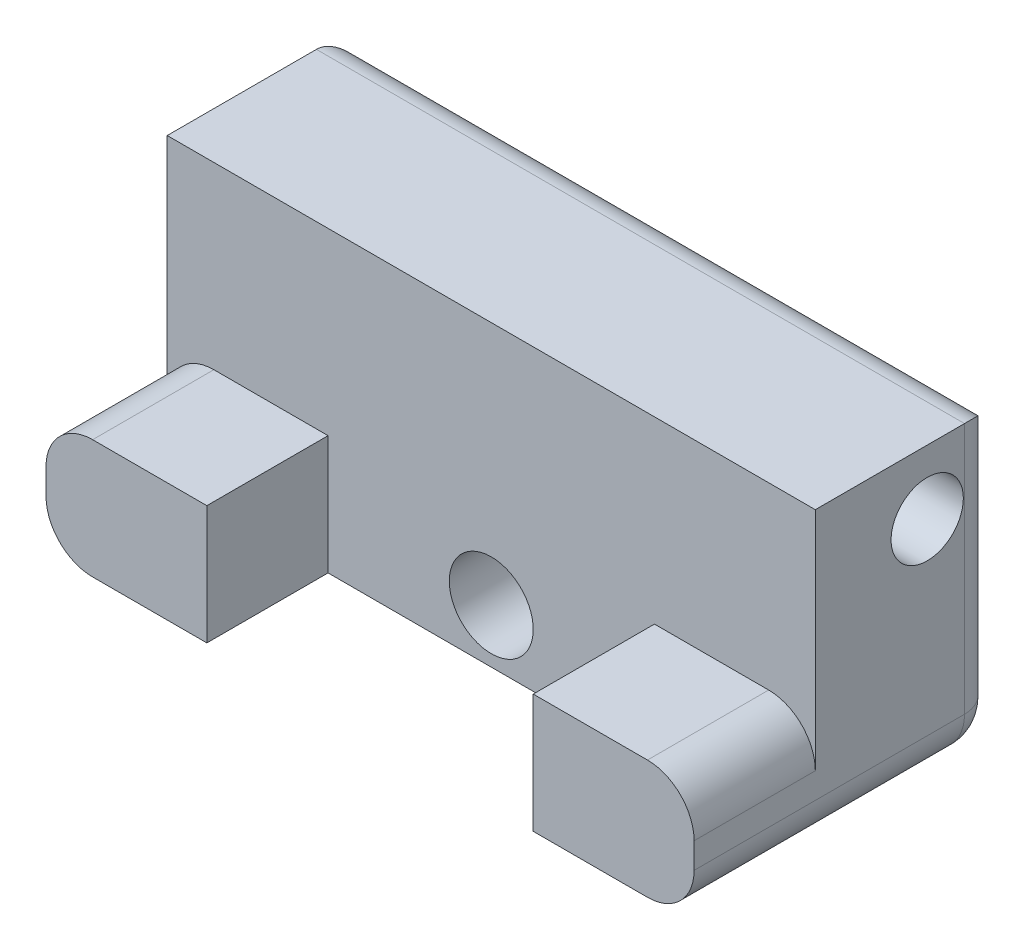
ISO-10303-21;
HEADER;
FILE_DESCRIPTION(('STEP AP214'),'2;1');
FILE_NAME('part.step','',(''),(''),'','','');
FILE_SCHEMA(('AUTOMOTIVE_DESIGN { 1 0 10303 214 1 1 1 1 }'));
ENDSEC;
DATA;
#1=APPLICATION_CONTEXT('core data for automotive mechanical design processes');
#2=APPLICATION_PROTOCOL_DEFINITION('international standard','automotive_design',2000,#1);
#3=PRODUCT_CONTEXT('',#1,'mechanical');
#4=PRODUCT('Part','Part','',(#3));
#5=PRODUCT_RELATED_PRODUCT_CATEGORY('part','',(#4));
#6=PRODUCT_DEFINITION_FORMATION('','',#4);
#7=PRODUCT_DEFINITION_CONTEXT('part definition',#1,'design');
#8=PRODUCT_DEFINITION('design','',#6,#7);
#9=PRODUCT_DEFINITION_SHAPE('','',#8);
#10=(LENGTH_UNIT() NAMED_UNIT(*) SI_UNIT(.MILLI.,.METRE.));
#11=(NAMED_UNIT(*) PLANE_ANGLE_UNIT() SI_UNIT($,.RADIAN.));
#12=(NAMED_UNIT(*) SI_UNIT($,.STERADIAN.) SOLID_ANGLE_UNIT());
#13=UNCERTAINTY_MEASURE_WITH_UNIT(LENGTH_MEASURE(1.E-05),#10,'distance_accuracy_value','');
#14=(GEOMETRIC_REPRESENTATION_CONTEXT(3) GLOBAL_UNCERTAINTY_ASSIGNED_CONTEXT((#13)) GLOBAL_UNIT_ASSIGNED_CONTEXT((#10,
#11,#12)) REPRESENTATION_CONTEXT('',''));
#15=CARTESIAN_POINT('',(0.,0.,0.));
#16=DIRECTION('',(0.,0.,1.));
#17=DIRECTION('',(1.,0.,0.));
#18=AXIS2_PLACEMENT_3D('',#15,#16,#17);
#19=CARTESIAN_POINT('',(27.8,0.,-13.));
#20=DIRECTION('',(0.,0.,1.));
#21=DIRECTION('',(1.,0.,0.));
#22=AXIS2_PLACEMENT_3D('',#19,#20,#21);
#23=PLANE('',#22);
#24=DIRECTION('',(0.,1.,0.));
#25=VECTOR('',#24,1.);
#26=CARTESIAN_POINT('',(1.4,0.,-13.));
#27=LINE('',#26,#25);
#28=CARTESIAN_POINT('',(1.4,2.7,-13.));
#29=VERTEX_POINT('',#28);
#30=CARTESIAN_POINT('',(1.4,12.1,-13.));
#31=VERTEX_POINT('',#30);
#32=EDGE_CURVE('E301',#29,#31,#27,.T.);
#33=ORIENTED_EDGE('',*,*,#32,.T.);
#34=DIRECTION('',(-1.,0.,0.));
#35=VECTOR('',#34,1.);
#36=CARTESIAN_POINT('',(27.8,12.1,-13.));
#37=LINE('',#36,#35);
#38=CARTESIAN_POINT('',(26.4,12.1,-13.));
#39=VERTEX_POINT('',#38);
#40=EDGE_CURVE('E303',#31,#39,#37,.F.);
#41=ORIENTED_EDGE('',*,*,#40,.T.);
#42=DIRECTION('',(0.,1.,0.));
#43=VECTOR('',#42,1.);
#44=CARTESIAN_POINT('',(26.4,2.7,-13.));
#45=LINE('',#44,#43);
#46=CARTESIAN_POINT('',(26.4,2.7,-13.));
#47=VERTEX_POINT('',#46);
#48=EDGE_CURVE('E289',#39,#47,#45,.F.);
#49=ORIENTED_EDGE('',*,*,#48,.T.);
#50=CARTESIAN_POINT('',(25.8,2.7,-13.));
#51=DIRECTION('',(0.,0.,1.));
#52=DIRECTION('',(1.,0.,0.));
#53=AXIS2_PLACEMENT_3D('',#50,#51,#52);
#54=CIRCLE('',#53,0.6);
#55=CARTESIAN_POINT('',(25.8,2.1,-13.));
#56=VERTEX_POINT('',#55);
#57=EDGE_CURVE('E291',#47,#56,#54,.F.);
#58=ORIENTED_EDGE('',*,*,#57,.T.);
#59=DIRECTION('',(1.,0.,0.));
#60=VECTOR('',#59,1.);
#61=CARTESIAN_POINT('',(27.8,2.1,-13.));
#62=LINE('',#61,#60);
#63=CARTESIAN_POINT('',(18.4620718977237,2.1,-13.));
#64=VERTEX_POINT('',#63);
#65=EDGE_CURVE('E293',#56,#64,#62,.F.);
#66=ORIENTED_EDGE('',*,*,#65,.T.);
#67=CARTESIAN_POINT('',(13.9,3.,-13.));
#68=DIRECTION('',(0.,0.,1.));
#69=DIRECTION('',(1.,0.,0.));
#70=AXIS2_PLACEMENT_3D('',#67,#68,#69);
#71=CIRCLE('',#70,4.65);
#72=CARTESIAN_POINT('',(9.33792810227633,2.1,-13.));
#73=VERTEX_POINT('',#72);
#74=EDGE_CURVE('E295',#64,#73,#71,.T.);
#75=ORIENTED_EDGE('',*,*,#74,.T.);
#76=DIRECTION('',(1.,0.,0.));
#77=VECTOR('',#76,1.);
#78=CARTESIAN_POINT('',(27.8,2.1,-13.));
#79=LINE('',#78,#77);
#80=CARTESIAN_POINT('',(2.,2.1,-13.));
#81=VERTEX_POINT('',#80);
#82=EDGE_CURVE('E297',#73,#81,#79,.F.);
#83=ORIENTED_EDGE('',*,*,#82,.T.);
#84=CARTESIAN_POINT('',(2.,2.7,-13.));
#85=DIRECTION('',(0.,0.,1.));
#86=DIRECTION('',(1.,0.,0.));
#87=AXIS2_PLACEMENT_3D('',#84,#85,#86);
#88=CIRCLE('',#87,0.6);
#89=EDGE_CURVE('E299',#81,#29,#88,.F.);
#90=ORIENTED_EDGE('',*,*,#89,.T.);
#91=EDGE_LOOP('',(#33,#41,#49,#58,#66,#75,#83,#90));
#92=FACE_BOUND('',#91,.T.);
#93=ADVANCED_FACE('F37',(#92),#23,.F.);
#94=CARTESIAN_POINT('',(27.8,5.8,0.));
#95=DIRECTION('',(0.,0.,-1.));
#96=DIRECTION('',(0.,1.,0.));
#97=AXIS2_PLACEMENT_3D('',#94,#95,#96);
#98=PLANE('',#97);
#99=DIRECTION('',(-1.,0.,0.));
#100=VECTOR('',#99,1.);
#101=CARTESIAN_POINT('',(27.8,5.8,0.));
#102=LINE('',#101,#100);
#103=CARTESIAN_POINT('',(6.9,5.8,0.));
#104=VERTEX_POINT('',#103);
#105=CARTESIAN_POINT('',(2.,5.8,0.));
#106=VERTEX_POINT('',#105);
#107=EDGE_CURVE('E233',#104,#106,#102,.T.);
#108=ORIENTED_EDGE('',*,*,#107,.T.);
#109=CARTESIAN_POINT('',(2.,3.8,0.));
#110=DIRECTION('',(0.,0.,-1.));
#111=DIRECTION('',(0.,1.,0.));
#112=AXIS2_PLACEMENT_3D('',#109,#110,#111);
#113=CIRCLE('',#112,2.);
#114=CARTESIAN_POINT('',(0.,3.8,0.));
#115=VERTEX_POINT('',#114);
#116=EDGE_CURVE('E274',#106,#115,#113,.F.);
#117=ORIENTED_EDGE('',*,*,#116,.T.);
#118=DIRECTION('',(0.,-1.,0.));
#119=VECTOR('',#118,1.);
#120=CARTESIAN_POINT('',(0.,5.8,0.));
#121=LINE('',#120,#119);
#122=CARTESIAN_POINT('',(0.,2.7,0.));
#123=VERTEX_POINT('',#122);
#124=EDGE_CURVE('E221',#115,#123,#121,.T.);
#125=ORIENTED_EDGE('',*,*,#124,.T.);
#126=CARTESIAN_POINT('',(2.,2.7,0.));
#127=DIRECTION('',(0.,0.,-1.));
#128=DIRECTION('',(0.,1.,0.));
#129=AXIS2_PLACEMENT_3D('',#126,#127,#128);
#130=CIRCLE('',#129,2.);
#131=CARTESIAN_POINT('',(2.,0.7,0.));
#132=VERTEX_POINT('',#131);
#133=EDGE_CURVE('E272',#123,#132,#130,.F.);
#134=ORIENTED_EDGE('',*,*,#133,.T.);
#135=DIRECTION('',(-1.,0.,0.));
#136=VECTOR('',#135,1.);
#137=CARTESIAN_POINT('',(0.,0.7,0.));
#138=LINE('',#137,#136);
#139=CARTESIAN_POINT('',(6.9,0.7,0.));
#140=VERTEX_POINT('',#139);
#141=EDGE_CURVE('E193',#140,#132,#138,.T.);
#142=ORIENTED_EDGE('',*,*,#141,.F.);
#143=DIRECTION('',(0.,1.,0.));
#144=VECTOR('',#143,1.);
#145=CARTESIAN_POINT('',(6.9,0.,0.));
#146=LINE('',#145,#144);
#147=EDGE_CURVE('E210',#140,#104,#146,.T.);
#148=ORIENTED_EDGE('',*,*,#147,.T.);
#149=EDGE_LOOP('',(#108,#117,#125,#134,#142,#148));
#150=FACE_BOUND('',#149,.T.);
#151=ADVANCED_FACE('F353',(#150),#98,.F.);
#152=CARTESIAN_POINT('',(27.8,5.8,-5.2));
#153=DIRECTION('',(0.,-1.,0.));
#154=DIRECTION('',(0.,0.,-1.));
#155=AXIS2_PLACEMENT_3D('',#152,#153,#154);
#156=PLANE('',#155);
#157=DIRECTION('',(-1.,0.,0.));
#158=VECTOR('',#157,1.);
#159=CARTESIAN_POINT('',(27.8,5.8,-5.2));
#160=LINE('',#159,#158);
#161=CARTESIAN_POINT('',(6.9,5.8,-5.2));
#162=VERTEX_POINT('',#161);
#163=CARTESIAN_POINT('',(2.,5.8,-5.2));
#164=VERTEX_POINT('',#163);
#165=EDGE_CURVE('E240',#162,#164,#160,.T.);
#166=ORIENTED_EDGE('',*,*,#165,.T.);
#167=DIRECTION('',(0.,0.,1.));
#168=VECTOR('',#167,1.);
#169=CARTESIAN_POINT('',(2.,5.8,-5.2));
#170=LINE('',#169,#168);
#171=EDGE_CURVE('E269',#164,#106,#170,.T.);
#172=ORIENTED_EDGE('',*,*,#171,.T.);
#173=ORIENTED_EDGE('',*,*,#107,.F.);
#174=DIRECTION('',(0.,0.,1.));
#175=VECTOR('',#174,1.);
#176=CARTESIAN_POINT('',(6.9,5.8,-5.2));
#177=LINE('',#176,#175);
#178=EDGE_CURVE('E250',#162,#104,#177,.T.);
#179=ORIENTED_EDGE('',*,*,#178,.F.);
#180=EDGE_LOOP('',(#166,#172,#173,#179));
#181=FACE_BOUND('',#180,.T.);
#182=ADVANCED_FACE('F359',(#181),#156,.F.);
#183=CARTESIAN_POINT('',(27.8,0.,0.));
#184=DIRECTION('',(1.,0.,0.));
#185=DIRECTION('',(0.,0.,-1.));
#186=AXIS2_PLACEMENT_3D('',#183,#184,#185);
#187=PLANE('',#186);
#188=DIRECTION('',(0.,0.,1.));
#189=VECTOR('',#188,1.);
#190=CARTESIAN_POINT('',(27.8,2.7,-13.));
#191=LINE('',#190,#189);
#192=CARTESIAN_POINT('',(27.8,2.7,0.));
#193=VERTEX_POINT('',#192);
#194=CARTESIAN_POINT('',(27.8,2.7,-11.6));
#195=VERTEX_POINT('',#194);
#196=EDGE_CURVE('E255',#193,#195,#191,.F.);
#197=ORIENTED_EDGE('',*,*,#196,.T.);
#198=DIRECTION('',(0.,1.,0.));
#199=VECTOR('',#198,1.);
#200=CARTESIAN_POINT('',(27.8,13.5,-11.6));
#201=LINE('',#200,#199);
#202=CARTESIAN_POINT('',(27.8,13.5,-11.6));
#203=VERTEX_POINT('',#202);
#204=EDGE_CURVE('E11',#195,#203,#201,.T.);
#205=ORIENTED_EDGE('',*,*,#204,.T.);
#206=DIRECTION('',(0.,0.,1.));
#207=VECTOR('',#206,1.);
#208=CARTESIAN_POINT('',(27.8,13.5,-13.));
#209=LINE('',#208,#207);
#210=CARTESIAN_POINT('',(27.8,13.5,-5.2));
#211=VERTEX_POINT('',#210);
#212=EDGE_CURVE('E228',#203,#211,#209,.T.);
#213=ORIENTED_EDGE('',*,*,#212,.T.);
#214=DIRECTION('',(0.,-1.,0.));
#215=VECTOR('',#214,1.);
#216=CARTESIAN_POINT('',(27.8,13.5,-5.2));
#217=LINE('',#216,#215);
#218=CARTESIAN_POINT('',(27.8,3.8,-5.2));
#219=VERTEX_POINT('',#218);
#220=EDGE_CURVE('E231',#211,#219,#217,.T.);
#221=ORIENTED_EDGE('',*,*,#220,.T.);
#222=DIRECTION('',(0.,0.,1.));
#223=VECTOR('',#222,1.);
#224=CARTESIAN_POINT('',(27.8,3.8,0.));
#225=LINE('',#224,#223);
#226=CARTESIAN_POINT('',(27.8,3.8,0.));
#227=VERTEX_POINT('',#226);
#228=EDGE_CURVE('E257',#219,#227,#225,.T.);
#229=ORIENTED_EDGE('',*,*,#228,.T.);
#230=DIRECTION('',(0.,-1.,0.));
#231=VECTOR('',#230,1.);
#232=CARTESIAN_POINT('',(27.8,5.8,0.));
#233=LINE('',#232,#231);
#234=EDGE_CURVE('E225',#227,#193,#233,.T.);
#235=ORIENTED_EDGE('',*,*,#234,.T.);
#236=EDGE_LOOP('',(#197,#205,#213,#221,#229,#235));
#237=FACE_BOUND('',#236,.T.);
#238=CARTESIAN_POINT('',(27.8,10.75,-10.));
#239=DIRECTION('',(1.,0.,0.));
#240=DIRECTION('',(0.,0.,-1.));
#241=AXIS2_PLACEMENT_3D('',#238,#239,#240);
#242=CIRCLE('',#241,1.55);
#243=CARTESIAN_POINT('',(27.8,10.75,-11.55));
#244=VERTEX_POINT('',#243);
#245=EDGE_CURVE('E218',#244,#244,#242,.T.);
#246=ORIENTED_EDGE('',*,*,#245,.F.);
#247=EDGE_LOOP('',(#246));
#248=FACE_BOUND('',#247,.T.);
#249=ADVANCED_FACE('F422',(#237,#248),#187,.T.);
#250=CARTESIAN_POINT('',(0.,0.,0.));
#251=DIRECTION('',(1.,0.,0.));
#252=DIRECTION('',(0.,0.,-1.));
#253=AXIS2_PLACEMENT_3D('',#250,#251,#252);
#254=PLANE('',#253);
#255=DIRECTION('',(0.,0.,1.));
#256=VECTOR('',#255,1.);
#257=CARTESIAN_POINT('',(0.,13.5,-13.));
#258=LINE('',#257,#256);
#259=CARTESIAN_POINT('',(0.,13.5,-11.6));
#260=VERTEX_POINT('',#259);
#261=CARTESIAN_POINT('',(0.,13.5,-5.2));
#262=VERTEX_POINT('',#261);
#263=EDGE_CURVE('E236',#260,#262,#258,.T.);
#264=ORIENTED_EDGE('',*,*,#263,.F.);
#265=DIRECTION('',(0.,1.,0.));
#266=VECTOR('',#265,1.);
#267=CARTESIAN_POINT('',(0.,0.,-11.6));
#268=LINE('',#267,#266);
#269=CARTESIAN_POINT('',(0.,2.7,-11.6));
#270=VERTEX_POINT('',#269);
#271=EDGE_CURVE('E306',#260,#270,#268,.F.);
#272=ORIENTED_EDGE('',*,*,#271,.T.);
#273=DIRECTION('',(0.,0.,-1.));
#274=VECTOR('',#273,1.);
#275=CARTESIAN_POINT('',(0.,2.7,0.));
#276=LINE('',#275,#274);
#277=EDGE_CURVE('E276',#270,#123,#276,.F.);
#278=ORIENTED_EDGE('',*,*,#277,.T.);
#279=ORIENTED_EDGE('',*,*,#124,.F.);
#280=DIRECTION('',(0.,0.,1.));
#281=VECTOR('',#280,1.);
#282=CARTESIAN_POINT('',(0.,3.8,0.));
#283=LINE('',#282,#281);
#284=CARTESIAN_POINT('',(0.,3.8,-5.2));
#285=VERTEX_POINT('',#284);
#286=EDGE_CURVE('E278',#115,#285,#283,.F.);
#287=ORIENTED_EDGE('',*,*,#286,.T.);
#288=DIRECTION('',(0.,-1.,0.));
#289=VECTOR('',#288,1.);
#290=CARTESIAN_POINT('',(0.,13.5,-5.2));
#291=LINE('',#290,#289);
#292=EDGE_CURVE('E229',#262,#285,#291,.T.);
#293=ORIENTED_EDGE('',*,*,#292,.F.);
#294=EDGE_LOOP('',(#264,#272,#278,#279,#287,#293));
#295=FACE_BOUND('',#294,.T.);
#296=CARTESIAN_POINT('',(0.,10.75,-10.));
#297=DIRECTION('',(1.,0.,0.));
#298=DIRECTION('',(0.,0.,-1.));
#299=AXIS2_PLACEMENT_3D('',#296,#297,#298);
#300=CIRCLE('',#299,1.55);
#301=CARTESIAN_POINT('',(0.,10.75,-11.55));
#302=VERTEX_POINT('',#301);
#303=EDGE_CURVE('E222',#302,#302,#300,.T.);
#304=ORIENTED_EDGE('',*,*,#303,.T.);
#305=EDGE_LOOP('',(#304));
#306=FACE_BOUND('',#305,.T.);
#307=ADVANCED_FACE('F367',(#295,#306),#254,.F.);
#308=ORIENTED_EDGE('',*,*,#234,.F.);
#309=CARTESIAN_POINT('',(25.8,3.8,0.));
#310=DIRECTION('',(0.,0.,-1.));
#311=DIRECTION('',(0.,1.,0.));
#312=AXIS2_PLACEMENT_3D('',#309,#310,#311);
#313=CIRCLE('',#312,2.);
#314=CARTESIAN_POINT('',(25.8,5.8,0.));
#315=VERTEX_POINT('',#314);
#316=EDGE_CURVE('E262',#227,#315,#313,.F.);
#317=ORIENTED_EDGE('',*,*,#316,.T.);
#318=CARTESIAN_POINT('',(20.9,5.8,0.));
#319=VERTEX_POINT('',#318);
#320=EDGE_CURVE('E209',#315,#319,#102,.T.);
#321=ORIENTED_EDGE('',*,*,#320,.T.);
#322=DIRECTION('',(0.,1.,0.));
#323=VECTOR('',#322,1.);
#324=CARTESIAN_POINT('',(20.9,0.,0.));
#325=LINE('',#324,#323);
#326=CARTESIAN_POINT('',(20.9,0.7,0.));
#327=VERTEX_POINT('',#326);
#328=EDGE_CURVE('E200',#327,#319,#325,.T.);
#329=ORIENTED_EDGE('',*,*,#328,.F.);
#330=CARTESIAN_POINT('',(25.8,0.7,0.));
#331=VERTEX_POINT('',#330);
#332=EDGE_CURVE('E182',#331,#327,#138,.T.);
#333=ORIENTED_EDGE('',*,*,#332,.F.);
#334=CARTESIAN_POINT('',(25.8,2.7,0.));
#335=DIRECTION('',(0.,0.,-1.));
#336=DIRECTION('',(0.,1.,0.));
#337=AXIS2_PLACEMENT_3D('',#334,#335,#336);
#338=CIRCLE('',#337,2.);
#339=EDGE_CURVE('E260',#331,#193,#338,.F.);
#340=ORIENTED_EDGE('',*,*,#339,.T.);
#341=EDGE_LOOP('',(#308,#317,#321,#329,#333,#340));
#342=FACE_BOUND('',#341,.T.);
#343=ADVANCED_FACE('F207',(#342),#98,.F.);
#344=CARTESIAN_POINT('',(27.8,13.5,-13.));
#345=DIRECTION('',(0.,-1.,0.));
#346=DIRECTION('',(0.,0.,-1.));
#347=AXIS2_PLACEMENT_3D('',#344,#345,#346);
#348=PLANE('',#347);
#349=ORIENTED_EDGE('',*,*,#212,.F.);
#350=DIRECTION('',(-1.,0.,0.));
#351=VECTOR('',#350,1.);
#352=CARTESIAN_POINT('',(27.8,13.5,-11.6));
#353=LINE('',#352,#351);
#354=EDGE_CURVE('E286',#203,#260,#353,.T.);
#355=ORIENTED_EDGE('',*,*,#354,.T.);
#356=ORIENTED_EDGE('',*,*,#263,.T.);
#357=DIRECTION('',(-1.,0.,0.));
#358=VECTOR('',#357,1.);
#359=CARTESIAN_POINT('',(27.8,13.5,-5.2));
#360=LINE('',#359,#358);
#361=EDGE_CURVE('E243',#211,#262,#360,.T.);
#362=ORIENTED_EDGE('',*,*,#361,.F.);
#363=EDGE_LOOP('',(#349,#355,#356,#362));
#364=FACE_BOUND('',#363,.T.);
#365=ADVANCED_FACE('F363',(#364),#348,.F.);
#366=CARTESIAN_POINT('',(27.8,13.5,-5.2));
#367=DIRECTION('',(0.,0.,-1.));
#368=DIRECTION('',(0.,1.,0.));
#369=AXIS2_PLACEMENT_3D('',#366,#367,#368);
#370=PLANE('',#369);
#371=CARTESIAN_POINT('',(13.9,3.,-5.2));
#372=DIRECTION('',(0.,0.,-1.));
#373=DIRECTION('',(0.,1.,0.));
#374=AXIS2_PLACEMENT_3D('',#371,#372,#373);
#375=CIRCLE('',#374,1.8);
#376=CARTESIAN_POINT('',(13.9,4.8,-5.2));
#377=VERTEX_POINT('',#376);
#378=EDGE_CURVE('E247',#377,#377,#375,.T.);
#379=ORIENTED_EDGE('',*,*,#378,.T.);
#380=EDGE_LOOP('',(#379));
#381=FACE_BOUND('',#380,.T.);
#382=DIRECTION('',(0.,1.,0.));
#383=VECTOR('',#382,1.);
#384=CARTESIAN_POINT('',(6.9,0.,-5.2));
#385=LINE('',#384,#383);
#386=CARTESIAN_POINT('',(6.9,0.699999999999999,-5.2));
#387=VERTEX_POINT('',#386);
#388=EDGE_CURVE('E212',#387,#162,#385,.T.);
#389=ORIENTED_EDGE('',*,*,#388,.F.);
#390=DIRECTION('',(1.,0.,0.));
#391=VECTOR('',#390,1.);
#392=CARTESIAN_POINT('',(27.8,0.699999999999999,-5.2));
#393=LINE('',#392,#391);
#394=CARTESIAN_POINT('',(20.9,0.7,-5.2));
#395=VERTEX_POINT('',#394);
#396=EDGE_CURVE('E204',#387,#395,#393,.T.);
#397=ORIENTED_EDGE('',*,*,#396,.T.);
#398=DIRECTION('',(0.,1.,0.));
#399=VECTOR('',#398,1.);
#400=CARTESIAN_POINT('',(20.9,0.,-5.2));
#401=LINE('',#400,#399);
#402=CARTESIAN_POINT('',(20.9,5.8,-5.2));
#403=VERTEX_POINT('',#402);
#404=EDGE_CURVE('E203',#395,#403,#401,.T.);
#405=ORIENTED_EDGE('',*,*,#404,.T.);
#406=CARTESIAN_POINT('',(25.8,5.8,-5.2));
#407=VERTEX_POINT('',#406);
#408=EDGE_CURVE('E241',#407,#403,#160,.T.);
#409=ORIENTED_EDGE('',*,*,#408,.F.);
#410=CARTESIAN_POINT('',(25.8,3.8,-5.2));
#411=DIRECTION('',(0.,0.,-1.));
#412=DIRECTION('',(0.,1.,0.));
#413=AXIS2_PLACEMENT_3D('',#410,#411,#412);
#414=CIRCLE('',#413,2.);
#415=EDGE_CURVE('E281',#407,#219,#414,.T.);
#416=ORIENTED_EDGE('',*,*,#415,.T.);
#417=ORIENTED_EDGE('',*,*,#220,.F.);
#418=ORIENTED_EDGE('',*,*,#361,.T.);
#419=ORIENTED_EDGE('',*,*,#292,.T.);
#420=CARTESIAN_POINT('',(2.,3.8,-5.2));
#421=DIRECTION('',(0.,0.,-1.));
#422=DIRECTION('',(0.,1.,0.));
#423=AXIS2_PLACEMENT_3D('',#420,#421,#422);
#424=CIRCLE('',#423,2.);
#425=EDGE_CURVE('E284',#285,#164,#424,.T.);
#426=ORIENTED_EDGE('',*,*,#425,.T.);
#427=ORIENTED_EDGE('',*,*,#165,.F.);
#428=EDGE_LOOP('',(#389,#397,#405,#409,#416,#417,#418,#419,#426,#427));
#429=FACE_BOUND('',#428,.T.);
#430=ADVANCED_FACE('F450',(#381,#429),#370,.F.);
#431=ORIENTED_EDGE('',*,*,#320,.F.);
#432=DIRECTION('',(0.,0.,1.));
#433=VECTOR('',#432,1.);
#434=CARTESIAN_POINT('',(25.8,5.8,-5.2));
#435=LINE('',#434,#433);
#436=EDGE_CURVE('E264',#315,#407,#435,.F.);
#437=ORIENTED_EDGE('',*,*,#436,.T.);
#438=ORIENTED_EDGE('',*,*,#408,.T.);
#439=DIRECTION('',(0.,0.,-1.));
#440=VECTOR('',#439,1.);
#441=CARTESIAN_POINT('',(20.9,5.8,-5.2));
#442=LINE('',#441,#440);
#443=EDGE_CURVE('E214',#319,#403,#442,.T.);
#444=ORIENTED_EDGE('',*,*,#443,.F.);
#445=EDGE_LOOP('',(#431,#437,#438,#444));
#446=FACE_BOUND('',#445,.T.);
#447=ADVANCED_FACE('F430',(#446),#156,.F.);
#448=CARTESIAN_POINT('',(27.8,10.75,-10.));
#449=DIRECTION('',(-1.,0.,0.));
#450=DIRECTION('',(0.,0.,1.));
#451=AXIS2_PLACEMENT_3D('',#448,#449,#450);
#452=CYLINDRICAL_SURFACE('',#451,1.55);
#453=ORIENTED_EDGE('',*,*,#245,.T.);
#454=EDGE_LOOP('',(#453));
#455=FACE_BOUND('',#454,.T.);
#456=ORIENTED_EDGE('',*,*,#303,.F.);
#457=EDGE_LOOP('',(#456));
#458=FACE_BOUND('',#457,.T.);
#459=ADVANCED_FACE('F482',(#455,#458),#452,.F.);
#460=CARTESIAN_POINT('',(6.9,0.,-5.2));
#461=DIRECTION('',(-1.,0.,0.));
#462=DIRECTION('',(0.,0.,1.));
#463=AXIS2_PLACEMENT_3D('',#460,#461,#462);
#464=PLANE('',#463);
#465=ORIENTED_EDGE('',*,*,#147,.F.);
#466=DIRECTION('',(0.,0.,-1.));
#467=VECTOR('',#466,1.);
#468=CARTESIAN_POINT('',(6.9,0.7,-5.2));
#469=LINE('',#468,#467);
#470=EDGE_CURVE('E443',#140,#387,#469,.T.);
#471=ORIENTED_EDGE('',*,*,#470,.T.);
#472=ORIENTED_EDGE('',*,*,#388,.T.);
#473=ORIENTED_EDGE('',*,*,#178,.T.);
#474=EDGE_LOOP('',(#465,#471,#472,#473));
#475=FACE_BOUND('',#474,.T.);
#476=ADVANCED_FACE('F441',(#475),#464,.F.);
#477=CARTESIAN_POINT('',(20.9,0.,-5.2));
#478=DIRECTION('',(1.,0.,0.));
#479=DIRECTION('',(0.,0.,-1.));
#480=AXIS2_PLACEMENT_3D('',#477,#478,#479);
#481=PLANE('',#480);
#482=ORIENTED_EDGE('',*,*,#404,.F.);
#483=DIRECTION('',(0.,0.,1.));
#484=VECTOR('',#483,1.);
#485=CARTESIAN_POINT('',(20.9,0.7,-5.2));
#486=LINE('',#485,#484);
#487=EDGE_CURVE('E186',#395,#327,#486,.T.);
#488=ORIENTED_EDGE('',*,*,#487,.T.);
#489=ORIENTED_EDGE('',*,*,#328,.T.);
#490=ORIENTED_EDGE('',*,*,#443,.T.);
#491=EDGE_LOOP('',(#482,#488,#489,#490));
#492=FACE_BOUND('',#491,.T.);
#493=ADVANCED_FACE('F198',(#492),#481,.F.);
#494=CARTESIAN_POINT('',(15.7,3.,-9.6));
#495=DIRECTION('',(0.,0.,1.));
#496=DIRECTION('',(1.,0.,0.));
#497=AXIS2_PLACEMENT_3D('',#494,#495,#496);
#498=PLANE('',#497);
#499=CARTESIAN_POINT('',(13.9,3.,-9.6));
#500=DIRECTION('',(0.,0.,-1.));
#501=DIRECTION('',(-1.,0.,0.));
#502=AXIS2_PLACEMENT_3D('',#499,#500,#501);
#503=CIRCLE('',#502,1.8);
#504=CARTESIAN_POINT('',(12.1,3.,-9.6));
#505=VERTEX_POINT('',#504);
#506=EDGE_CURVE('E251',#505,#505,#503,.T.);
#507=ORIENTED_EDGE('',*,*,#506,.F.);
#508=EDGE_LOOP('',(#507));
#509=FACE_BOUND('',#508,.T.);
#510=CARTESIAN_POINT('',(13.9,3.,-9.6));
#511=DIRECTION('',(0.,0.,-1.));
#512=DIRECTION('',(-1.,0.,0.));
#513=AXIS2_PLACEMENT_3D('',#510,#511,#512);
#514=CIRCLE('',#513,3.25);
#515=CARTESIAN_POINT('',(11.603807499359,0.7,-9.6));
#516=VERTEX_POINT('',#515);
#517=CARTESIAN_POINT('',(16.196192500641,0.7,-9.6));
#518=VERTEX_POINT('',#517);
#519=EDGE_CURVE('E413',#516,#518,#514,.T.);
#520=ORIENTED_EDGE('',*,*,#519,.T.);
#521=DIRECTION('',(-1.,0.,0.));
#522=VECTOR('',#521,1.);
#523=CARTESIAN_POINT('',(15.7,0.7,-9.6));
#524=LINE('',#523,#522);
#525=EDGE_CURVE('E192',#518,#516,#524,.T.);
#526=ORIENTED_EDGE('',*,*,#525,.T.);
#527=EDGE_LOOP('',(#520,#526));
#528=FACE_BOUND('',#527,.T.);
#529=ADVANCED_FACE('F467',(#509,#528),#498,.F.);
#530=CARTESIAN_POINT('',(13.9,3.,-13.));
#531=DIRECTION('',(0.,0.,-1.));
#532=DIRECTION('',(-1.,0.,0.));
#533=AXIS2_PLACEMENT_3D('',#530,#531,#532);
#534=CYLINDRICAL_SURFACE('',#533,1.8);
#535=ORIENTED_EDGE('',*,*,#506,.T.);
#536=EDGE_LOOP('',(#535));
#537=FACE_BOUND('',#536,.T.);
#538=ORIENTED_EDGE('',*,*,#378,.F.);
#539=EDGE_LOOP('',(#538));
#540=FACE_BOUND('',#539,.T.);
#541=ADVANCED_FACE('F464',(#537,#540),#534,.F.);
#542=CARTESIAN_POINT('',(13.9,3.,-13.));
#543=DIRECTION('',(0.,0.,-1.));
#544=DIRECTION('',(-1.,0.,0.));
#545=AXIS2_PLACEMENT_3D('',#542,#543,#544);
#546=CYLINDRICAL_SURFACE('',#545,3.25);
#547=DIRECTION('',(0.,0.,-1.));
#548=VECTOR('',#547,1.);
#549=CARTESIAN_POINT('',(11.603807499359,0.7,-13.));
#550=LINE('',#549,#548);
#551=CARTESIAN_POINT('',(11.603807499359,0.7,-11.6));
#552=VERTEX_POINT('',#551);
#553=EDGE_CURVE('E246',#516,#552,#550,.T.);
#554=ORIENTED_EDGE('',*,*,#553,.T.);
#555=CARTESIAN_POINT('',(13.9,3.,-11.6));
#556=DIRECTION('',(0.,0.,1.));
#557=DIRECTION('',(1.,0.,0.));
#558=AXIS2_PLACEMENT_3D('',#555,#556,#557);
#559=CIRCLE('',#558,3.25);
#560=CARTESIAN_POINT('',(16.196192500641,0.7,-11.6));
#561=VERTEX_POINT('',#560);
#562=EDGE_CURVE('E67',#552,#561,#559,.F.);
#563=ORIENTED_EDGE('',*,*,#562,.T.);
#564=DIRECTION('',(0.,0.,-1.));
#565=VECTOR('',#564,1.);
#566=CARTESIAN_POINT('',(16.196192500641,0.7,-13.));
#567=LINE('',#566,#565);
#568=EDGE_CURVE('E253',#561,#518,#567,.F.);
#569=ORIENTED_EDGE('',*,*,#568,.T.);
#570=ORIENTED_EDGE('',*,*,#519,.F.);
#571=EDGE_LOOP('',(#554,#563,#569,#570));
#572=FACE_BOUND('',#571,.T.);
#573=ADVANCED_FACE('F411',(#572),#546,.F.);
#574=CARTESIAN_POINT('',(0.,0.7,0.));
#575=DIRECTION('',(0.,1.,0.));
#576=DIRECTION('',(0.,0.,1.));
#577=AXIS2_PLACEMENT_3D('',#574,#575,#576);
#578=PLANE('',#577);
#579=DIRECTION('',(0.,0.,-1.));
#580=VECTOR('',#579,1.);
#581=CARTESIAN_POINT('',(2.,0.7,0.));
#582=LINE('',#581,#580);
#583=CARTESIAN_POINT('',(2.,0.7,-11.6));
#584=VERTEX_POINT('',#583);
#585=EDGE_CURVE('E266',#132,#584,#582,.T.);
#586=ORIENTED_EDGE('',*,*,#585,.T.);
#587=DIRECTION('',(1.,0.,0.));
#588=VECTOR('',#587,1.);
#589=CARTESIAN_POINT('',(0.,0.7,-11.6));
#590=LINE('',#589,#588);
#591=EDGE_CURVE('E312',#584,#552,#590,.T.);
#592=ORIENTED_EDGE('',*,*,#591,.T.);
#593=ORIENTED_EDGE('',*,*,#553,.F.);
#594=ORIENTED_EDGE('',*,*,#525,.F.);
#595=ORIENTED_EDGE('',*,*,#568,.F.);
#596=DIRECTION('',(1.,0.,0.));
#597=VECTOR('',#596,1.);
#598=CARTESIAN_POINT('',(0.,0.7,-11.6));
#599=LINE('',#598,#597);
#600=CARTESIAN_POINT('',(25.8,0.7,-11.6));
#601=VERTEX_POINT('',#600);
#602=EDGE_CURVE('E310',#561,#601,#599,.T.);
#603=ORIENTED_EDGE('',*,*,#602,.T.);
#604=DIRECTION('',(0.,0.,1.));
#605=VECTOR('',#604,1.);
#606=CARTESIAN_POINT('',(25.8,0.7,0.));
#607=LINE('',#606,#605);
#608=EDGE_CURVE('E188',#601,#331,#607,.T.);
#609=ORIENTED_EDGE('',*,*,#608,.T.);
#610=ORIENTED_EDGE('',*,*,#332,.T.);
#611=ORIENTED_EDGE('',*,*,#487,.F.);
#612=ORIENTED_EDGE('',*,*,#396,.F.);
#613=ORIENTED_EDGE('',*,*,#470,.F.);
#614=ORIENTED_EDGE('',*,*,#141,.T.);
#615=EDGE_LOOP('',(#586,#592,#593,#594,#595,#603,#609,#610,#611,#612,#613,#614));
#616=FACE_BOUND('',#615,.T.);
#617=ADVANCED_FACE('F185',(#616),#578,.F.);
#618=CARTESIAN_POINT('',(25.8,3.8,0.));
#619=DIRECTION('',(0.,0.,-1.));
#620=DIRECTION('',(0.,1.,0.));
#621=AXIS2_PLACEMENT_3D('',#618,#619,#620);
#622=CYLINDRICAL_SURFACE('',#621,2.);
#623=ORIENTED_EDGE('',*,*,#415,.F.);
#624=ORIENTED_EDGE('',*,*,#436,.F.);
#625=ORIENTED_EDGE('',*,*,#316,.F.);
#626=ORIENTED_EDGE('',*,*,#228,.F.);
#627=EDGE_LOOP('',(#623,#624,#625,#626));
#628=FACE_BOUND('',#627,.T.);
#629=ADVANCED_FACE('F368',(#628),#622,.T.);
#630=CARTESIAN_POINT('',(25.8,2.7,0.));
#631=DIRECTION('',(0.,0.,-1.));
#632=DIRECTION('',(-1.,0.,0.));
#633=AXIS2_PLACEMENT_3D('',#630,#631,#632);
#634=CYLINDRICAL_SURFACE('',#633,2.);
#635=ORIENTED_EDGE('',*,*,#608,.F.);
#636=CARTESIAN_POINT('',(25.8,2.7,-11.6));
#637=DIRECTION('',(0.,0.,1.));
#638=DIRECTION('',(1.,0.,0.));
#639=AXIS2_PLACEMENT_3D('',#636,#637,#638);
#640=CIRCLE('',#639,2.);
#641=EDGE_CURVE('E52',#601,#195,#640,.T.);
#642=ORIENTED_EDGE('',*,*,#641,.T.);
#643=ORIENTED_EDGE('',*,*,#196,.F.);
#644=ORIENTED_EDGE('',*,*,#339,.F.);
#645=EDGE_LOOP('',(#635,#642,#643,#644));
#646=FACE_BOUND('',#645,.T.);
#647=ADVANCED_FACE('F371',(#646),#634,.T.);
#648=CARTESIAN_POINT('',(2.,3.8,-5.2));
#649=DIRECTION('',(0.,0.,1.));
#650=DIRECTION('',(0.,-1.,0.));
#651=AXIS2_PLACEMENT_3D('',#648,#649,#650);
#652=CYLINDRICAL_SURFACE('',#651,2.);
#653=ORIENTED_EDGE('',*,*,#425,.F.);
#654=ORIENTED_EDGE('',*,*,#286,.F.);
#655=ORIENTED_EDGE('',*,*,#116,.F.);
#656=ORIENTED_EDGE('',*,*,#171,.F.);
#657=EDGE_LOOP('',(#653,#654,#655,#656));
#658=FACE_BOUND('',#657,.T.);
#659=ADVANCED_FACE('F375',(#658),#652,.T.);
#660=CARTESIAN_POINT('',(2.,2.7,0.));
#661=DIRECTION('',(0.,0.,-1.));
#662=DIRECTION('',(-1.,0.,0.));
#663=AXIS2_PLACEMENT_3D('',#660,#661,#662);
#664=CYLINDRICAL_SURFACE('',#663,2.);
#665=ORIENTED_EDGE('',*,*,#277,.F.);
#666=CARTESIAN_POINT('',(2.,2.7,-11.6));
#667=DIRECTION('',(0.,0.,1.));
#668=DIRECTION('',(1.,0.,0.));
#669=AXIS2_PLACEMENT_3D('',#666,#667,#668);
#670=CIRCLE('',#669,2.);
#671=EDGE_CURVE('E308',#270,#584,#670,.T.);
#672=ORIENTED_EDGE('',*,*,#671,.T.);
#673=ORIENTED_EDGE('',*,*,#585,.F.);
#674=ORIENTED_EDGE('',*,*,#133,.F.);
#675=EDGE_LOOP('',(#665,#672,#673,#674));
#676=FACE_BOUND('',#675,.T.);
#677=ADVANCED_FACE('F378',(#676),#664,.T.);
#678=CARTESIAN_POINT('',(13.9,3.,-11.6));
#679=DIRECTION('',(0.,0.,1.));
#680=DIRECTION('',(1.,0.,0.));
#681=AXIS2_PLACEMENT_3D('',#678,#679,#680);
#682=TOROIDAL_SURFACE('',#681,4.65,1.4);
#683=CARTESIAN_POINT('',(11.603807499359,0.7,-11.6));
#684=CARTESIAN_POINT('',(11.6038150140462,0.699997451226281,-11.6174102647841));
#685=CARTESIAN_POINT('',(11.6030219145852,0.700324981167973,-11.634809072628));
#686=CARTESIAN_POINT('',(11.5999051435191,0.701615542673797,-11.6694174768848));
#687=CARTESIAN_POINT('',(11.5975839773253,0.702577533982639,-11.686627336217));
#688=CARTESIAN_POINT('',(11.5885250214419,0.706340513925436,-11.7372789518048));
#689=CARTESIAN_POINT('',(11.5796869957823,0.710020222461375,-11.7702926215496));
#690=CARTESIAN_POINT('',(11.5539949024673,0.720813802876132,-11.8442215511819));
#691=CARTESIAN_POINT('',(11.5355119833932,0.728635563139443,-11.8844467781897));
#692=CARTESIAN_POINT('',(11.4930528081214,0.74688668662605,-11.9614797983314));
#693=CARTESIAN_POINT('',(11.469038737355,0.757334047165825,-11.9982614953104));
#694=CARTESIAN_POINT('',(11.419660062218,0.779191840469031,-12.0654029421009));
#695=CARTESIAN_POINT('',(11.3945960247103,0.790438752114516,-12.0960430037803));
#696=CARTESIAN_POINT('',(11.3423360910969,0.814275499570494,-12.1549050850394));
#697=CARTESIAN_POINT('',(11.315138353462,0.826866498877161,-12.1831249708863));
#698=CARTESIAN_POINT('',(11.2312618487035,0.866356427207521,-12.2646722503816));
#699=CARTESIAN_POINT('',(11.172329375038,0.894959372930275,-12.3148500680826));
#700=CARTESIAN_POINT('',(11.0492989244386,0.956762484549978,-12.4101392236603));
#701=CARTESIAN_POINT('',(10.9850945854107,0.990083375989014,-12.4550282105837));
#702=CARTESIAN_POINT('',(10.8546639837657,1.06011833158767,-12.5389526413871));
#703=CARTESIAN_POINT('',(10.7884358903914,1.09683553290766,-12.5779825842375));
#704=CARTESIAN_POINT('',(10.6547371975107,1.17340087973398,-12.6508132401986));
#705=CARTESIAN_POINT('',(10.5872644644668,1.21325487731271,-12.6846038124539));
#706=CARTESIAN_POINT('',(10.4517269340752,1.29580986567656,-12.7471528856868));
#707=CARTESIAN_POINT('',(10.3836620366668,1.33851134606965,-12.7759105181829));
#708=CARTESIAN_POINT('',(10.2336488514889,1.43540035494996,-12.833732049188));
#709=CARTESIAN_POINT('',(10.1516522684781,1.49017460472411,-12.8617020446445));
#710=CARTESIAN_POINT('',(9.98789464650863,1.60318311734551,-12.9103288404266));
#711=CARTESIAN_POINT('',(9.90613372772516,1.66141889932327,-12.9309824017682));
#712=CARTESIAN_POINT('',(9.66245170200215,1.84037507434906,-12.9812660198797));
#713=CARTESIAN_POINT('',(9.50128190533433,1.96589384093711,-12.9995496177894));
#714=CARTESIAN_POINT('',(9.34181947464114,2.09680232110622,-12.9999972504659));
#715=CARTESIAN_POINT('',(9.33987350696407,2.09840087351213,-12.999999990038));
#716=CARTESIAN_POINT('',(9.33792810227633,2.1,-13.));
#717=B_SPLINE_CURVE_WITH_KNOTS('',3,(#683,#684,#685,#686,#687,#688,#689,#690,#691,#692,#693,
#694,#695,#696,#697,#698,#699,#700,#701,#702,#703,#704,#705,#706,#707,#708,#709,#710,#711,#712,
#713,#714,#715,#716),.UNSPECIFIED.,.F.,.F.,(4,2,2,2,2,2,2,2,2,2,2,2,2,2,2,2,4),(0.,
0.0521891972195141,0.104293037671511,0.20687760977393,0.340991405806201,0.476050837104878,
0.599328180938374,0.722713117477076,0.96962931779215,1.22470887991273,1.48002645697162,
1.73583219575795,1.99168203282451,2.29881255997496,2.60607888433848,3.21744868606856,
3.22500377716551),.UNSPECIFIED.);
#718=EDGE_CURVE('E331',#73,#552,#717,.F.);
#719=ORIENTED_EDGE('',*,*,#718,.F.);
#720=ORIENTED_EDGE('',*,*,#74,.F.);
#721=CARTESIAN_POINT('',(16.196192500641,0.7,-11.6));
#722=CARTESIAN_POINT('',(16.1961849859538,0.699997451226281,-11.6174102647841));
#723=CARTESIAN_POINT('',(16.1969780854148,0.700324981167973,-11.634809072628));
#724=CARTESIAN_POINT('',(16.2000948564809,0.701615542673797,-11.6694174768848));
#725=CARTESIAN_POINT('',(16.2024160226747,0.702577533982639,-11.686627336217));
#726=CARTESIAN_POINT('',(16.2114749785581,0.706340513925436,-11.7372789518048));
#727=CARTESIAN_POINT('',(16.2203130042177,0.710020222461375,-11.7702926215496));
#728=CARTESIAN_POINT('',(16.2460050975327,0.720813802876132,-11.8442215511819));
#729=CARTESIAN_POINT('',(16.2644880166068,0.728635563139443,-11.8844467781897));
#730=CARTESIAN_POINT('',(16.3069471918786,0.74688668662605,-11.9614797983314));
#731=CARTESIAN_POINT('',(16.330961262645,0.757334047165825,-11.9982614953104));
#732=CARTESIAN_POINT('',(16.3803399377821,0.779191840469031,-12.0654029421009));
#733=CARTESIAN_POINT('',(16.4054039752897,0.790438752114516,-12.0960430037803));
#734=CARTESIAN_POINT('',(16.4576639089031,0.814275499570493,-12.1549050850394));
#735=CARTESIAN_POINT('',(16.484861646538,0.826866498877161,-12.1831249708863));
#736=CARTESIAN_POINT('',(16.5687381512965,0.866356427207521,-12.2646722503816));
#737=CARTESIAN_POINT('',(16.627670624962,0.894959372930274,-12.3148500680826));
#738=CARTESIAN_POINT('',(16.7507010755614,0.956762484549974,-12.4101392236603));
#739=CARTESIAN_POINT('',(16.8149054145893,0.990083375989009,-12.4550282105837));
#740=CARTESIAN_POINT('',(16.9453360162343,1.06011833158766,-12.5389526413871));
#741=CARTESIAN_POINT('',(17.0115641096086,1.09683553290765,-12.5779825842375));
#742=CARTESIAN_POINT('',(17.1452628024893,1.17340087973397,-12.6508132401986));
#743=CARTESIAN_POINT('',(17.2127355355331,1.2132548773127,-12.6846038124539));
#744=CARTESIAN_POINT('',(17.3482730659248,1.29580986567655,-12.7471528856868));
#745=CARTESIAN_POINT('',(17.4163379633332,1.33851134606964,-12.7759105181829));
#746=CARTESIAN_POINT('',(17.5663511485111,1.43540035494995,-12.833732049188));
#747=CARTESIAN_POINT('',(17.6483477315219,1.49017460472409,-12.8617020446445));
#748=CARTESIAN_POINT('',(17.8121053534914,1.60318311734553,-12.9103288404266));
#749=CARTESIAN_POINT('',(17.8938662722748,1.66141889932332,-12.9309824017682));
#750=CARTESIAN_POINT('',(18.1375482979979,1.84037507434898,-12.9812660198797));
#751=CARTESIAN_POINT('',(18.2987180946661,1.96589384093664,-12.9995496177894));
#752=CARTESIAN_POINT('',(18.4581805253589,2.09680232110621,-12.9999972504659));
#753=CARTESIAN_POINT('',(18.4601264930359,2.09840087351213,-12.999999990038));
#754=CARTESIAN_POINT('',(18.4620718977237,2.1,-13.));
#755=B_SPLINE_CURVE_WITH_KNOTS('',3,(#721,#722,#723,#724,#725,#726,#727,#728,#729,#730,#731,
#732,#733,#734,#735,#736,#737,#738,#739,#740,#741,#742,#743,#744,#745,#746,#747,#748,#749,#750,
#751,#752,#753,#754),.UNSPECIFIED.,.F.,.F.,(4,2,2,2,2,2,2,2,2,2,2,2,2,2,2,2,4),(0.,
0.0521891972195141,0.104293037671511,0.206877609773931,0.340991405806201,0.476050837104877,
0.599328180938375,0.722713117477072,0.969629317792144,1.22470887991271,1.48002645697159,
1.73583219575793,1.99168203282449,2.29881255997496,2.6060788843385,3.21744868606856,
3.22500377716551),.UNSPECIFIED.);
#756=EDGE_CURVE('E42',#561,#64,#755,.T.);
#757=ORIENTED_EDGE('',*,*,#756,.F.);
#758=ORIENTED_EDGE('',*,*,#562,.F.);
#759=EDGE_LOOP('',(#719,#720,#757,#758));
#760=FACE_BOUND('',#759,.T.);
#761=ADVANCED_FACE('F337',(#760),#682,.T.);
#762=CARTESIAN_POINT('',(0.,2.1,-11.6));
#763=DIRECTION('',(1.,0.,0.));
#764=DIRECTION('',(0.,0.,-1.));
#765=AXIS2_PLACEMENT_3D('',#762,#763,#764);
#766=CYLINDRICAL_SURFACE('',#765,1.4);
#767=ORIENTED_EDGE('',*,*,#756,.T.);
#768=ORIENTED_EDGE('',*,*,#65,.F.);
#769=CARTESIAN_POINT('',(25.8,2.1,-11.6));
#770=DIRECTION('',(1.,0.,0.));
#771=DIRECTION('',(0.,0.,-1.));
#772=AXIS2_PLACEMENT_3D('',#769,#770,#771);
#773=CIRCLE('',#772,1.4);
#774=EDGE_CURVE('E329',#601,#56,#773,.T.);
#775=ORIENTED_EDGE('',*,*,#774,.F.);
#776=ORIENTED_EDGE('',*,*,#602,.F.);
#777=EDGE_LOOP('',(#767,#768,#775,#776));
#778=FACE_BOUND('',#777,.T.);
#779=ADVANCED_FACE('F39',(#778),#766,.T.);
#780=CARTESIAN_POINT('',(0.,2.1,-11.6));
#781=DIRECTION('',(1.,0.,0.));
#782=DIRECTION('',(0.,0.,-1.));
#783=AXIS2_PLACEMENT_3D('',#780,#781,#782);
#784=CYLINDRICAL_SURFACE('',#783,1.4);
#785=ORIENTED_EDGE('',*,*,#718,.T.);
#786=ORIENTED_EDGE('',*,*,#591,.F.);
#787=CARTESIAN_POINT('',(2.,2.1,-11.6));
#788=DIRECTION('',(-1.,0.,0.));
#789=DIRECTION('',(0.,0.,1.));
#790=AXIS2_PLACEMENT_3D('',#787,#788,#789);
#791=CIRCLE('',#790,1.4);
#792=EDGE_CURVE('E326',#81,#584,#791,.T.);
#793=ORIENTED_EDGE('',*,*,#792,.F.);
#794=ORIENTED_EDGE('',*,*,#82,.F.);
#795=EDGE_LOOP('',(#785,#786,#793,#794));
#796=FACE_BOUND('',#795,.T.);
#797=ADVANCED_FACE('F340',(#796),#784,.T.);
#798=CARTESIAN_POINT('',(25.8,2.7,-11.6));
#799=DIRECTION('',(0.,0.,1.));
#800=DIRECTION('',(1.,0.,0.));
#801=AXIS2_PLACEMENT_3D('',#798,#799,#800);
#802=DEGENERATE_TOROIDAL_SURFACE('',#801,0.6,1.4,.T.);
#803=ORIENTED_EDGE('',*,*,#774,.T.);
#804=ORIENTED_EDGE('',*,*,#57,.F.);
#805=CARTESIAN_POINT('',(26.4,2.7,-11.6));
#806=DIRECTION('',(0.,1.,0.));
#807=DIRECTION('',(0.,0.,1.));
#808=AXIS2_PLACEMENT_3D('',#805,#806,#807);
#809=CIRCLE('',#808,1.4);
#810=EDGE_CURVE('E323',#195,#47,#809,.T.);
#811=ORIENTED_EDGE('',*,*,#810,.F.);
#812=ORIENTED_EDGE('',*,*,#641,.F.);
#813=EDGE_LOOP('',(#803,#804,#811,#812));
#814=FACE_BOUND('',#813,.T.);
#815=ADVANCED_FACE('F343',(#814),#802,.T.);
#816=CARTESIAN_POINT('',(2.,2.7,-11.6));
#817=DIRECTION('',(0.,0.,1.));
#818=DIRECTION('',(1.,0.,0.));
#819=AXIS2_PLACEMENT_3D('',#816,#817,#818);
#820=DEGENERATE_TOROIDAL_SURFACE('',#819,0.6,1.4,.T.);
#821=ORIENTED_EDGE('',*,*,#792,.T.);
#822=ORIENTED_EDGE('',*,*,#671,.F.);
#823=CARTESIAN_POINT('',(1.4,2.7,-11.6));
#824=DIRECTION('',(0.,1.,0.));
#825=DIRECTION('',(0.,0.,1.));
#826=AXIS2_PLACEMENT_3D('',#823,#824,#825);
#827=CIRCLE('',#826,1.4);
#828=EDGE_CURVE('E320',#29,#270,#827,.T.);
#829=ORIENTED_EDGE('',*,*,#828,.F.);
#830=ORIENTED_EDGE('',*,*,#89,.F.);
#831=EDGE_LOOP('',(#821,#822,#829,#830));
#832=FACE_BOUND('',#831,.T.);
#833=ADVANCED_FACE('F349',(#832),#820,.T.);
#834=CARTESIAN_POINT('',(26.4,0.,-11.6));
#835=DIRECTION('',(0.,-1.,0.));
#836=DIRECTION('',(0.,0.,-1.));
#837=AXIS2_PLACEMENT_3D('',#834,#835,#836);
#838=CYLINDRICAL_SURFACE('',#837,1.4);
#839=ORIENTED_EDGE('',*,*,#810,.T.);
#840=ORIENTED_EDGE('',*,*,#48,.F.);
#841=CARTESIAN_POINT('',(26.4,12.1,-11.6));
#842=DIRECTION('',(0.707106781186547,-0.707106781186547,0.));
#843=DIRECTION('',(-0.707106781186547,-0.707106781186547,0.));
#844=AXIS2_PLACEMENT_3D('',#841,#842,#843);
#845=ELLIPSE('',#844,1.97989898732233,1.4);
#846=EDGE_CURVE('E318',#203,#39,#845,.F.);
#847=ORIENTED_EDGE('',*,*,#846,.F.);
#848=ORIENTED_EDGE('',*,*,#204,.F.);
#849=EDGE_LOOP('',(#839,#840,#847,#848));
#850=FACE_BOUND('',#849,.T.);
#851=ADVANCED_FACE('F390',(#850),#838,.T.);
#852=CARTESIAN_POINT('',(1.4,0.,-11.6));
#853=DIRECTION('',(0.,1.,0.));
#854=DIRECTION('',(0.,0.,1.));
#855=AXIS2_PLACEMENT_3D('',#852,#853,#854);
#856=CYLINDRICAL_SURFACE('',#855,1.4);
#857=ORIENTED_EDGE('',*,*,#828,.T.);
#858=ORIENTED_EDGE('',*,*,#271,.F.);
#859=CARTESIAN_POINT('',(1.4,12.1,-11.6));
#860=DIRECTION('',(0.707106781186547,0.707106781186547,0.));
#861=DIRECTION('',(-0.707106781186547,0.707106781186547,0.));
#862=AXIS2_PLACEMENT_3D('',#859,#860,#861);
#863=ELLIPSE('',#862,1.97989898732233,1.4);
#864=EDGE_CURVE('E316',#31,#260,#863,.T.);
#865=ORIENTED_EDGE('',*,*,#864,.F.);
#866=ORIENTED_EDGE('',*,*,#32,.F.);
#867=EDGE_LOOP('',(#857,#858,#865,#866));
#868=FACE_BOUND('',#867,.T.);
#869=ADVANCED_FACE('F386',(#868),#856,.T.);
#870=CARTESIAN_POINT('',(27.8,12.1,-11.6));
#871=DIRECTION('',(-1.,0.,0.));
#872=DIRECTION('',(0.,0.,1.));
#873=AXIS2_PLACEMENT_3D('',#870,#871,#872);
#874=CYLINDRICAL_SURFACE('',#873,1.4);
#875=ORIENTED_EDGE('',*,*,#846,.T.);
#876=ORIENTED_EDGE('',*,*,#40,.F.);
#877=ORIENTED_EDGE('',*,*,#864,.T.);
#878=ORIENTED_EDGE('',*,*,#354,.F.);
#879=EDGE_LOOP('',(#875,#876,#877,#878));
#880=FACE_BOUND('',#879,.T.);
#881=ADVANCED_FACE('F383',(#880),#874,.T.);
#882=CLOSED_SHELL('',(#93,#151,#182,#249,#307,#343,#365,#430,#447,#459,#476,#493,#529,#541,#573,
#617,#629,#647,#659,#677,#761,#779,#797,#815,#833,#851,#869,#881));
#883=MANIFOLD_SOLID_BREP('B2',#882);
#884=ADVANCED_BREP_SHAPE_REPRESENTATION('',(#18,#883),#14);
#885=SHAPE_DEFINITION_REPRESENTATION(#9,#884);
ENDSEC;
END-ISO-10303-21;
